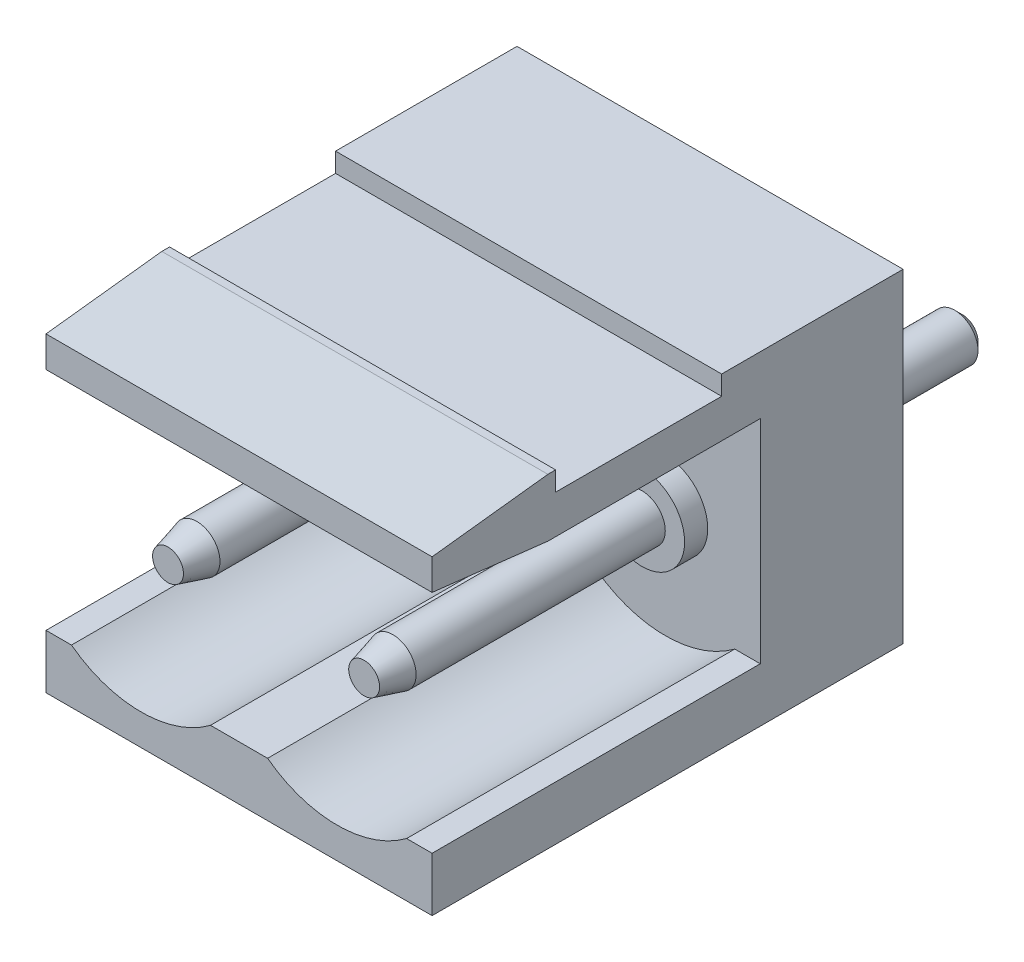
ISO-10303-21;
HEADER;
FILE_DESCRIPTION(('STEP AP214'),'2;1');
FILE_NAME('part.step','',(''),(''),'','','');
FILE_SCHEMA(('AUTOMOTIVE_DESIGN { 1 0 10303 214 1 1 1 1 }'));
ENDSEC;
DATA;
#1=APPLICATION_CONTEXT('core data for automotive mechanical design processes');
#2=APPLICATION_PROTOCOL_DEFINITION('international standard','automotive_design',2000,#1);
#3=PRODUCT_CONTEXT('',#1,'mechanical');
#4=PRODUCT('Part','Part','',(#3));
#5=PRODUCT_RELATED_PRODUCT_CATEGORY('part','',(#4));
#6=PRODUCT_DEFINITION_FORMATION('','',#4);
#7=PRODUCT_DEFINITION_CONTEXT('part definition',#1,'design');
#8=PRODUCT_DEFINITION('design','',#6,#7);
#9=PRODUCT_DEFINITION_SHAPE('','',#8);
#10=(LENGTH_UNIT() NAMED_UNIT(*) SI_UNIT(.MILLI.,.METRE.));
#11=(NAMED_UNIT(*) PLANE_ANGLE_UNIT() SI_UNIT($,.RADIAN.));
#12=(NAMED_UNIT(*) SI_UNIT($,.STERADIAN.) SOLID_ANGLE_UNIT());
#13=UNCERTAINTY_MEASURE_WITH_UNIT(LENGTH_MEASURE(1.E-05),#10,'distance_accuracy_value','');
#14=(GEOMETRIC_REPRESENTATION_CONTEXT(3) GLOBAL_UNCERTAINTY_ASSIGNED_CONTEXT((#13)) GLOBAL_UNIT_ASSIGNED_CONTEXT((#10,
#11,#12)) REPRESENTATION_CONTEXT('',''));
#15=CARTESIAN_POINT('',(0.,0.,0.));
#16=DIRECTION('',(0.,0.,1.));
#17=DIRECTION('',(1.,0.,0.));
#18=AXIS2_PLACEMENT_3D('',#15,#16,#17);
#19=CARTESIAN_POINT('',(0.,8.4,12.2));
#20=DIRECTION('',(0.,-1.,0.));
#21=DIRECTION('',(0.,0.,-1.));
#22=AXIS2_PLACEMENT_3D('',#19,#20,#21);
#23=PLANE('',#22);
#24=DIRECTION('',(0.,0.,-1.));
#25=VECTOR('',#24,1.);
#26=CARTESIAN_POINT('',(0.,8.4,12.2));
#27=LINE('',#26,#25);
#28=CARTESIAN_POINT('',(0.,8.4,4.7));
#29=VERTEX_POINT('',#28);
#30=CARTESIAN_POINT('',(0.,8.4,0.));
#31=VERTEX_POINT('',#30);
#32=EDGE_CURVE('E340',#29,#31,#27,.T.);
#33=ORIENTED_EDGE('',*,*,#32,.F.);
#34=DIRECTION('',(-1.,0.,0.));
#35=VECTOR('',#34,1.);
#36=CARTESIAN_POINT('',(10.,8.4,4.7));
#37=LINE('',#36,#35);
#38=CARTESIAN_POINT('',(10.,8.4,4.7));
#39=VERTEX_POINT('',#38);
#40=EDGE_CURVE('E216',#39,#29,#37,.T.);
#41=ORIENTED_EDGE('',*,*,#40,.F.);
#42=DIRECTION('',(0.,0.,-1.));
#43=VECTOR('',#42,1.);
#44=CARTESIAN_POINT('',(10.,8.4,12.2));
#45=LINE('',#44,#43);
#46=CARTESIAN_POINT('',(10.,8.4,0.));
#47=VERTEX_POINT('',#46);
#48=EDGE_CURVE('E196',#39,#47,#45,.T.);
#49=ORIENTED_EDGE('',*,*,#48,.T.);
#50=DIRECTION('',(-1.,0.,0.));
#51=VECTOR('',#50,1.);
#52=CARTESIAN_POINT('',(0.,8.4,0.));
#53=LINE('',#52,#51);
#54=EDGE_CURVE('E350',#47,#31,#53,.T.);
#55=ORIENTED_EDGE('',*,*,#54,.T.);
#56=EDGE_LOOP('',(#33,#41,#49,#55));
#57=FACE_BOUND('',#56,.T.);
#58=ADVANCED_FACE('F45',(#57),#23,.F.);
#59=CARTESIAN_POINT('',(0.,0.,12.2));
#60=DIRECTION('',(0.,0.,-1.));
#61=DIRECTION('',(-1.,0.,0.));
#62=AXIS2_PLACEMENT_3D('',#59,#60,#61);
#63=PLANE('',#62);
#64=DIRECTION('',(0.,1.,0.));
#65=VECTOR('',#64,1.);
#66=CARTESIAN_POINT('',(10.,0.,12.2));
#67=LINE('',#66,#65);
#68=CARTESIAN_POINT('',(10.,7.25,12.2));
#69=VERTEX_POINT('',#68);
#70=CARTESIAN_POINT('',(10.,8.05,12.2));
#71=VERTEX_POINT('',#70);
#72=EDGE_CURVE('E335',#69,#71,#67,.T.);
#73=ORIENTED_EDGE('',*,*,#72,.T.);
#74=DIRECTION('',(-1.,0.,0.));
#75=VECTOR('',#74,1.);
#76=CARTESIAN_POINT('',(10.,8.05,12.2));
#77=LINE('',#76,#75);
#78=CARTESIAN_POINT('',(0.,8.05,12.2));
#79=VERTEX_POINT('',#78);
#80=EDGE_CURVE('E213',#71,#79,#77,.T.);
#81=ORIENTED_EDGE('',*,*,#80,.T.);
#82=DIRECTION('',(0.,-1.,0.));
#83=VECTOR('',#82,1.);
#84=CARTESIAN_POINT('',(0.,0.,12.2));
#85=LINE('',#84,#83);
#86=CARTESIAN_POINT('',(0.,7.25,12.2));
#87=VERTEX_POINT('',#86);
#88=EDGE_CURVE('E327',#79,#87,#85,.T.);
#89=ORIENTED_EDGE('',*,*,#88,.T.);
#90=DIRECTION('',(-1.,0.,0.));
#91=VECTOR('',#90,1.);
#92=CARTESIAN_POINT('',(10.,7.25,12.2));
#93=LINE('',#92,#91);
#94=EDGE_CURVE('E231',#69,#87,#93,.T.);
#95=ORIENTED_EDGE('',*,*,#94,.F.);
#96=EDGE_LOOP('',(#73,#81,#89,#95));
#97=FACE_BOUND('',#96,.T.);
#98=ADVANCED_FACE('F429',(#97),#63,.F.);
#99=CARTESIAN_POINT('',(0.,0.,12.2));
#100=DIRECTION('',(1.,0.,0.));
#101=DIRECTION('',(0.,0.,-1.));
#102=AXIS2_PLACEMENT_3D('',#99,#100,#101);
#103=PLANE('',#102);
#104=DIRECTION('',(0.,0.,1.));
#105=VECTOR('',#104,1.);
#106=CARTESIAN_POINT('',(0.,7.9,4.7));
#107=LINE('',#106,#105);
#108=CARTESIAN_POINT('',(0.,7.9,4.7));
#109=VERTEX_POINT('',#108);
#110=CARTESIAN_POINT('',(0.,7.9,9.));
#111=VERTEX_POINT('',#110);
#112=EDGE_CURVE('E203',#109,#111,#107,.T.);
#113=ORIENTED_EDGE('',*,*,#112,.F.);
#114=DIRECTION('',(0.,-1.,0.));
#115=VECTOR('',#114,1.);
#116=CARTESIAN_POINT('',(0.,8.4,4.7));
#117=LINE('',#116,#115);
#118=EDGE_CURVE('E177',#29,#109,#117,.T.);
#119=ORIENTED_EDGE('',*,*,#118,.F.);
#120=ORIENTED_EDGE('',*,*,#32,.T.);
#121=DIRECTION('',(0.,-1.,0.));
#122=VECTOR('',#121,1.);
#123=CARTESIAN_POINT('',(0.,0.,0.));
#124=LINE('',#123,#122);
#125=CARTESIAN_POINT('',(0.,0.,0.));
#126=VERTEX_POINT('',#125);
#127=EDGE_CURVE('E303',#31,#126,#124,.T.);
#128=ORIENTED_EDGE('',*,*,#127,.T.);
#129=DIRECTION('',(0.,0.,-1.));
#130=VECTOR('',#129,1.);
#131=CARTESIAN_POINT('',(0.,0.,12.2));
#132=LINE('',#131,#130);
#133=CARTESIAN_POINT('',(0.,0.,12.2));
#134=VERTEX_POINT('',#133);
#135=EDGE_CURVE('E364',#134,#126,#132,.T.);
#136=ORIENTED_EDGE('',*,*,#135,.F.);
#137=CARTESIAN_POINT('',(0.,1.4,12.2));
#138=VERTEX_POINT('',#137);
#139=EDGE_CURVE('E332',#138,#134,#85,.T.);
#140=ORIENTED_EDGE('',*,*,#139,.F.);
#141=DIRECTION('',(0.,0.,1.));
#142=VECTOR('',#141,1.);
#143=CARTESIAN_POINT('',(0.,1.4,3.7));
#144=LINE('',#143,#142);
#145=CARTESIAN_POINT('',(0.,1.4,3.7));
#146=VERTEX_POINT('',#145);
#147=EDGE_CURVE('E300',#146,#138,#144,.T.);
#148=ORIENTED_EDGE('',*,*,#147,.F.);
#149=DIRECTION('',(0.,-1.,0.));
#150=VECTOR('',#149,1.);
#151=CARTESIAN_POINT('',(0.,1.4,3.7));
#152=LINE('',#151,#150);
#153=CARTESIAN_POINT('',(0.,6.9,3.7));
#154=VERTEX_POINT('',#153);
#155=EDGE_CURVE('E279',#154,#146,#152,.T.);
#156=ORIENTED_EDGE('',*,*,#155,.F.);
#157=DIRECTION('',(0.,0.,1.));
#158=VECTOR('',#157,1.);
#159=CARTESIAN_POINT('',(0.,6.9,3.7));
#160=LINE('',#159,#158);
#161=CARTESIAN_POINT('',(0.,6.9,9.2));
#162=VERTEX_POINT('',#161);
#163=EDGE_CURVE('E304',#154,#162,#160,.T.);
#164=ORIENTED_EDGE('',*,*,#163,.T.);
#165=DIRECTION('',(0.,-0.115880699560178,-0.993263139087243));
#166=VECTOR('',#165,1.);
#167=CARTESIAN_POINT('',(0.,6.9,9.2));
#168=LINE('',#167,#166);
#169=EDGE_CURVE('E242',#87,#162,#168,.T.);
#170=ORIENTED_EDGE('',*,*,#169,.F.);
#171=ORIENTED_EDGE('',*,*,#88,.F.);
#172=DIRECTION('',(0.,-0.115880699560178,0.993263139087243));
#173=VECTOR('',#172,1.);
#174=CARTESIAN_POINT('',(0.,8.4,9.2));
#175=LINE('',#174,#173);
#176=CARTESIAN_POINT('',(0.,8.4,9.2));
#177=VERTEX_POINT('',#176);
#178=EDGE_CURVE('E228',#177,#79,#175,.T.);
#179=ORIENTED_EDGE('',*,*,#178,.F.);
#180=CARTESIAN_POINT('',(0.,8.4,9.));
#181=VERTEX_POINT('',#180);
#182=EDGE_CURVE('E356',#177,#181,#27,.T.);
#183=ORIENTED_EDGE('',*,*,#182,.T.);
#184=DIRECTION('',(0.,1.,0.));
#185=VECTOR('',#184,1.);
#186=CARTESIAN_POINT('',(0.,8.4,9.));
#187=LINE('',#186,#185);
#188=EDGE_CURVE('E69',#111,#181,#187,.T.);
#189=ORIENTED_EDGE('',*,*,#188,.F.);
#190=EDGE_LOOP('',(#113,#119,#120,#128,#136,#140,#148,#156,#164,#170,#171,#179,#183,#189));
#191=FACE_BOUND('',#190,.T.);
#192=ADVANCED_FACE('F436',(#191),#103,.F.);
#193=CARTESIAN_POINT('',(0.,0.,12.2));
#194=DIRECTION('',(0.,1.,0.));
#195=DIRECTION('',(0.,0.,1.));
#196=AXIS2_PLACEMENT_3D('',#193,#194,#195);
#197=PLANE('',#196);
#198=DIRECTION('',(1.,0.,0.));
#199=VECTOR('',#198,1.);
#200=CARTESIAN_POINT('',(0.,0.,0.));
#201=LINE('',#200,#199);
#202=CARTESIAN_POINT('',(10.,0.,0.));
#203=VERTEX_POINT('',#202);
#204=EDGE_CURVE('E344',#126,#203,#201,.T.);
#205=ORIENTED_EDGE('',*,*,#204,.T.);
#206=DIRECTION('',(0.,0.,-1.));
#207=VECTOR('',#206,1.);
#208=CARTESIAN_POINT('',(10.,0.,12.2));
#209=LINE('',#208,#207);
#210=CARTESIAN_POINT('',(10.,0.,12.2));
#211=VERTEX_POINT('',#210);
#212=EDGE_CURVE('E360',#211,#203,#209,.T.);
#213=ORIENTED_EDGE('',*,*,#212,.F.);
#214=DIRECTION('',(1.,0.,0.));
#215=VECTOR('',#214,1.);
#216=CARTESIAN_POINT('',(0.,0.,12.2));
#217=LINE('',#216,#215);
#218=EDGE_CURVE('E331',#134,#211,#217,.T.);
#219=ORIENTED_EDGE('',*,*,#218,.F.);
#220=ORIENTED_EDGE('',*,*,#135,.T.);
#221=EDGE_LOOP('',(#205,#213,#219,#220));
#222=FACE_BOUND('',#221,.T.);
#223=ADVANCED_FACE('F451',(#222),#197,.F.);
#224=CARTESIAN_POINT('',(10.,0.,12.2));
#225=DIRECTION('',(-1.,0.,0.));
#226=DIRECTION('',(0.,0.,1.));
#227=AXIS2_PLACEMENT_3D('',#224,#225,#226);
#228=PLANE('',#227);
#229=ORIENTED_EDGE('',*,*,#48,.F.);
#230=DIRECTION('',(0.,-1.,0.));
#231=VECTOR('',#230,1.);
#232=CARTESIAN_POINT('',(10.,8.4,4.7));
#233=LINE('',#232,#231);
#234=CARTESIAN_POINT('',(10.,7.9,4.7));
#235=VERTEX_POINT('',#234);
#236=EDGE_CURVE('E174',#39,#235,#233,.T.);
#237=ORIENTED_EDGE('',*,*,#236,.T.);
#238=DIRECTION('',(0.,0.,1.));
#239=VECTOR('',#238,1.);
#240=CARTESIAN_POINT('',(10.,7.9,4.7));
#241=LINE('',#240,#239);
#242=CARTESIAN_POINT('',(10.,7.9,9.));
#243=VERTEX_POINT('',#242);
#244=EDGE_CURVE('E186',#235,#243,#241,.T.);
#245=ORIENTED_EDGE('',*,*,#244,.T.);
#246=DIRECTION('',(0.,1.,0.));
#247=VECTOR('',#246,1.);
#248=CARTESIAN_POINT('',(10.,8.4,9.));
#249=LINE('',#248,#247);
#250=CARTESIAN_POINT('',(10.,8.4,9.));
#251=VERTEX_POINT('',#250);
#252=EDGE_CURVE('E183',#243,#251,#249,.T.);
#253=ORIENTED_EDGE('',*,*,#252,.T.);
#254=CARTESIAN_POINT('',(10.,8.4,9.2));
#255=VERTEX_POINT('',#254);
#256=EDGE_CURVE('E359',#255,#251,#45,.T.);
#257=ORIENTED_EDGE('',*,*,#256,.F.);
#258=DIRECTION('',(0.,-0.115880699560178,0.993263139087243));
#259=VECTOR('',#258,1.);
#260=CARTESIAN_POINT('',(10.,8.4,9.2));
#261=LINE('',#260,#259);
#262=EDGE_CURVE('E61',#255,#71,#261,.T.);
#263=ORIENTED_EDGE('',*,*,#262,.T.);
#264=ORIENTED_EDGE('',*,*,#72,.F.);
#265=DIRECTION('',(0.,-0.115880699560178,-0.993263139087243));
#266=VECTOR('',#265,1.);
#267=CARTESIAN_POINT('',(10.,6.9,9.2));
#268=LINE('',#267,#266);
#269=CARTESIAN_POINT('',(10.,6.9,9.2));
#270=VERTEX_POINT('',#269);
#271=EDGE_CURVE('E237',#69,#270,#268,.T.);
#272=ORIENTED_EDGE('',*,*,#271,.T.);
#273=DIRECTION('',(0.,0.,1.));
#274=VECTOR('',#273,1.);
#275=CARTESIAN_POINT('',(10.,6.9,3.7));
#276=LINE('',#275,#274);
#277=CARTESIAN_POINT('',(10.,6.9,3.7));
#278=VERTEX_POINT('',#277);
#279=EDGE_CURVE('E308',#278,#270,#276,.T.);
#280=ORIENTED_EDGE('',*,*,#279,.F.);
#281=DIRECTION('',(0.,1.,0.));
#282=VECTOR('',#281,1.);
#283=CARTESIAN_POINT('',(10.,1.4,3.7));
#284=LINE('',#283,#282);
#285=CARTESIAN_POINT('',(10.,1.4,3.7));
#286=VERTEX_POINT('',#285);
#287=EDGE_CURVE('E271',#286,#278,#284,.T.);
#288=ORIENTED_EDGE('',*,*,#287,.F.);
#289=DIRECTION('',(0.,0.,1.));
#290=VECTOR('',#289,1.);
#291=CARTESIAN_POINT('',(10.,1.4,3.7));
#292=LINE('',#291,#290);
#293=CARTESIAN_POINT('',(10.,1.4,12.2));
#294=VERTEX_POINT('',#293);
#295=EDGE_CURVE('E312',#286,#294,#292,.T.);
#296=ORIENTED_EDGE('',*,*,#295,.T.);
#297=EDGE_CURVE('E336',#211,#294,#67,.T.);
#298=ORIENTED_EDGE('',*,*,#297,.F.);
#299=ORIENTED_EDGE('',*,*,#212,.T.);
#300=DIRECTION('',(0.,1.,0.));
#301=VECTOR('',#300,1.);
#302=CARTESIAN_POINT('',(10.,0.,0.));
#303=LINE('',#302,#301);
#304=EDGE_CURVE('E347',#203,#47,#303,.T.);
#305=ORIENTED_EDGE('',*,*,#304,.T.);
#306=EDGE_LOOP('',(#229,#237,#245,#253,#257,#263,#264,#272,#280,#288,#296,#298,#299,#305));
#307=FACE_BOUND('',#306,.T.);
#308=ADVANCED_FACE('F194',(#307),#228,.F.);
#309=ORIENTED_EDGE('',*,*,#256,.T.);
#310=DIRECTION('',(-1.,0.,0.));
#311=VECTOR('',#310,1.);
#312=CARTESIAN_POINT('',(10.,8.4,9.));
#313=LINE('',#312,#311);
#314=EDGE_CURVE('E220',#251,#181,#313,.T.);
#315=ORIENTED_EDGE('',*,*,#314,.T.);
#316=ORIENTED_EDGE('',*,*,#182,.F.);
#317=DIRECTION('',(-1.,0.,0.));
#318=VECTOR('',#317,1.);
#319=CARTESIAN_POINT('',(10.,8.4,9.2));
#320=LINE('',#319,#318);
#321=EDGE_CURVE('E227',#255,#177,#320,.T.);
#322=ORIENTED_EDGE('',*,*,#321,.F.);
#323=EDGE_LOOP('',(#309,#315,#316,#322));
#324=FACE_BOUND('',#323,.T.);
#325=ADVANCED_FACE('F432',(#324),#23,.F.);
#326=CARTESIAN_POINT('',(2.46,3.8,12.2));
#327=DIRECTION('',(0.,0.,1.));
#328=DIRECTION('',(1.,0.,0.));
#329=AXIS2_PLACEMENT_3D('',#326,#327,#328);
#330=CIRCLE('',#329,3.);
#331=CARTESIAN_POINT('',(0.659999999999999,1.4,12.2));
#332=VERTEX_POINT('',#331);
#333=CARTESIAN_POINT('',(4.26,1.4,12.2));
#334=VERTEX_POINT('',#333);
#335=EDGE_CURVE('E286',#332,#334,#330,.T.);
#336=ORIENTED_EDGE('',*,*,#335,.F.);
#337=DIRECTION('',(1.,0.,0.));
#338=VECTOR('',#337,1.);
#339=CARTESIAN_POINT('',(0.,1.4,12.2));
#340=LINE('',#339,#338);
#341=EDGE_CURVE('E219',#138,#332,#340,.T.);
#342=ORIENTED_EDGE('',*,*,#341,.F.);
#343=ORIENTED_EDGE('',*,*,#139,.T.);
#344=ORIENTED_EDGE('',*,*,#218,.T.);
#345=ORIENTED_EDGE('',*,*,#297,.T.);
#346=DIRECTION('',(1.,0.,0.));
#347=VECTOR('',#346,1.);
#348=CARTESIAN_POINT('',(9.34,1.4,12.2));
#349=LINE('',#348,#347);
#350=CARTESIAN_POINT('',(9.34,1.4,12.2));
#351=VERTEX_POINT('',#350);
#352=EDGE_CURVE('E256',#351,#294,#349,.T.);
#353=ORIENTED_EDGE('',*,*,#352,.F.);
#354=CARTESIAN_POINT('',(7.54,3.8,12.2));
#355=DIRECTION('',(0.,0.,1.));
#356=DIRECTION('',(1.,0.,0.));
#357=AXIS2_PLACEMENT_3D('',#354,#355,#356);
#358=CIRCLE('',#357,3.);
#359=CARTESIAN_POINT('',(5.74,1.4,12.2));
#360=VERTEX_POINT('',#359);
#361=EDGE_CURVE('E294',#360,#351,#358,.T.);
#362=ORIENTED_EDGE('',*,*,#361,.F.);
#363=DIRECTION('',(1.,0.,0.));
#364=VECTOR('',#363,1.);
#365=CARTESIAN_POINT('',(4.26,1.4,12.2));
#366=LINE('',#365,#364);
#367=EDGE_CURVE('E290',#334,#360,#366,.T.);
#368=ORIENTED_EDGE('',*,*,#367,.F.);
#369=EDGE_LOOP('',(#336,#342,#343,#344,#345,#353,#362,#368));
#370=FACE_BOUND('',#369,.T.);
#371=ADVANCED_FACE('F439',(#370),#63,.F.);
#372=CARTESIAN_POINT('',(0.,0.,0.));
#373=DIRECTION('',(0.,0.,-1.));
#374=DIRECTION('',(-1.,0.,0.));
#375=AXIS2_PLACEMENT_3D('',#372,#373,#374);
#376=PLANE('',#375);
#377=CARTESIAN_POINT('',(2.46,3.75,0.));
#378=DIRECTION('',(0.,0.,-1.));
#379=DIRECTION('',(-1.,0.,0.));
#380=AXIS2_PLACEMENT_3D('',#377,#378,#379);
#381=CIRCLE('',#380,0.6);
#382=CARTESIAN_POINT('',(1.86,3.75,0.));
#383=VERTEX_POINT('',#382);
#384=EDGE_CURVE('E373',#383,#383,#381,.T.);
#385=ORIENTED_EDGE('',*,*,#384,.F.);
#386=EDGE_LOOP('',(#385));
#387=FACE_BOUND('',#386,.T.);
#388=CARTESIAN_POINT('',(7.54,3.75,0.));
#389=DIRECTION('',(0.,0.,-1.));
#390=DIRECTION('',(-1.,0.,0.));
#391=AXIS2_PLACEMENT_3D('',#388,#389,#390);
#392=CIRCLE('',#391,0.6);
#393=CARTESIAN_POINT('',(6.94,3.75,0.));
#394=VERTEX_POINT('',#393);
#395=EDGE_CURVE('E206',#394,#394,#392,.T.);
#396=ORIENTED_EDGE('',*,*,#395,.F.);
#397=EDGE_LOOP('',(#396));
#398=FACE_BOUND('',#397,.T.);
#399=ORIENTED_EDGE('',*,*,#127,.F.);
#400=ORIENTED_EDGE('',*,*,#54,.F.);
#401=ORIENTED_EDGE('',*,*,#304,.F.);
#402=ORIENTED_EDGE('',*,*,#204,.F.);
#403=EDGE_LOOP('',(#399,#400,#401,#402));
#404=FACE_BOUND('',#403,.T.);
#405=ADVANCED_FACE('F449',(#387,#398,#404),#376,.T.);
#406=CARTESIAN_POINT('',(0.,1.4,3.7));
#407=DIRECTION('',(0.,-1.,0.));
#408=DIRECTION('',(0.,0.,-1.));
#409=AXIS2_PLACEMENT_3D('',#406,#407,#408);
#410=PLANE('',#409);
#411=ORIENTED_EDGE('',*,*,#341,.T.);
#412=DIRECTION('',(0.,0.,1.));
#413=VECTOR('',#412,1.);
#414=CARTESIAN_POINT('',(0.659999999999999,1.4,3.7));
#415=LINE('',#414,#413);
#416=CARTESIAN_POINT('',(0.659999999999999,1.4,3.7));
#417=VERTEX_POINT('',#416);
#418=EDGE_CURVE('E283',#417,#332,#415,.T.);
#419=ORIENTED_EDGE('',*,*,#418,.F.);
#420=DIRECTION('',(1.,0.,0.));
#421=VECTOR('',#420,1.);
#422=CARTESIAN_POINT('',(0.,1.4,3.7));
#423=LINE('',#422,#421);
#424=EDGE_CURVE('E251',#146,#417,#423,.T.);
#425=ORIENTED_EDGE('',*,*,#424,.F.);
#426=ORIENTED_EDGE('',*,*,#147,.T.);
#427=EDGE_LOOP('',(#411,#419,#425,#426));
#428=FACE_BOUND('',#427,.T.);
#429=ADVANCED_FACE('F562',(#428),#410,.F.);
#430=CARTESIAN_POINT('',(0.,6.9,3.7));
#431=DIRECTION('',(0.,1.,0.));
#432=DIRECTION('',(0.,0.,1.));
#433=AXIS2_PLACEMENT_3D('',#430,#431,#432);
#434=PLANE('',#433);
#435=ORIENTED_EDGE('',*,*,#279,.T.);
#436=DIRECTION('',(-1.,0.,0.));
#437=VECTOR('',#436,1.);
#438=CARTESIAN_POINT('',(10.,6.9,9.2));
#439=LINE('',#438,#437);
#440=EDGE_CURVE('E241',#270,#162,#439,.T.);
#441=ORIENTED_EDGE('',*,*,#440,.T.);
#442=ORIENTED_EDGE('',*,*,#163,.F.);
#443=DIRECTION('',(-1.,0.,0.));
#444=VECTOR('',#443,1.);
#445=CARTESIAN_POINT('',(0.,6.9,3.7));
#446=LINE('',#445,#444);
#447=EDGE_CURVE('E275',#278,#154,#446,.T.);
#448=ORIENTED_EDGE('',*,*,#447,.F.);
#449=EDGE_LOOP('',(#435,#441,#442,#448));
#450=FACE_BOUND('',#449,.T.);
#451=ADVANCED_FACE('F599',(#450),#434,.F.);
#452=CARTESIAN_POINT('',(9.34,1.4,3.7));
#453=DIRECTION('',(0.,-1.,0.));
#454=DIRECTION('',(0.,0.,-1.));
#455=AXIS2_PLACEMENT_3D('',#452,#453,#454);
#456=PLANE('',#455);
#457=ORIENTED_EDGE('',*,*,#352,.T.);
#458=ORIENTED_EDGE('',*,*,#295,.F.);
#459=DIRECTION('',(1.,0.,0.));
#460=VECTOR('',#459,1.);
#461=CARTESIAN_POINT('',(9.34,1.4,3.7));
#462=LINE('',#461,#460);
#463=CARTESIAN_POINT('',(9.34,1.4,3.7));
#464=VERTEX_POINT('',#463);
#465=EDGE_CURVE('E268',#464,#286,#462,.T.);
#466=ORIENTED_EDGE('',*,*,#465,.F.);
#467=DIRECTION('',(0.,0.,1.));
#468=VECTOR('',#467,1.);
#469=CARTESIAN_POINT('',(9.34,1.4,3.7));
#470=LINE('',#469,#468);
#471=EDGE_CURVE('E315',#464,#351,#470,.T.);
#472=ORIENTED_EDGE('',*,*,#471,.T.);
#473=EDGE_LOOP('',(#457,#458,#466,#472));
#474=FACE_BOUND('',#473,.T.);
#475=ADVANCED_FACE('F578',(#474),#456,.F.);
#476=CARTESIAN_POINT('',(7.54,3.8,3.7));
#477=DIRECTION('',(0.,0.,1.));
#478=DIRECTION('',(1.,0.,0.));
#479=AXIS2_PLACEMENT_3D('',#476,#477,#478);
#480=CYLINDRICAL_SURFACE('',#479,3.);
#481=ORIENTED_EDGE('',*,*,#361,.T.);
#482=ORIENTED_EDGE('',*,*,#471,.F.);
#483=CARTESIAN_POINT('',(7.54,3.8,3.7));
#484=DIRECTION('',(0.,0.,1.));
#485=DIRECTION('',(1.,0.,0.));
#486=AXIS2_PLACEMENT_3D('',#483,#484,#485);
#487=CIRCLE('',#486,3.);
#488=CARTESIAN_POINT('',(5.74,1.4,3.7));
#489=VERTEX_POINT('',#488);
#490=EDGE_CURVE('E264',#489,#464,#487,.T.);
#491=ORIENTED_EDGE('',*,*,#490,.F.);
#492=DIRECTION('',(0.,0.,1.));
#493=VECTOR('',#492,1.);
#494=CARTESIAN_POINT('',(5.74,1.4,3.7));
#495=LINE('',#494,#493);
#496=EDGE_CURVE('E318',#489,#360,#495,.T.);
#497=ORIENTED_EDGE('',*,*,#496,.T.);
#498=EDGE_LOOP('',(#481,#482,#491,#497));
#499=FACE_BOUND('',#498,.T.);
#500=ADVANCED_FACE('F574',(#499),#480,.F.);
#501=CARTESIAN_POINT('',(4.26,1.4,3.7));
#502=DIRECTION('',(0.,-1.,0.));
#503=DIRECTION('',(0.,0.,-1.));
#504=AXIS2_PLACEMENT_3D('',#501,#502,#503);
#505=PLANE('',#504);
#506=ORIENTED_EDGE('',*,*,#367,.T.);
#507=ORIENTED_EDGE('',*,*,#496,.F.);
#508=DIRECTION('',(1.,0.,0.));
#509=VECTOR('',#508,1.);
#510=CARTESIAN_POINT('',(4.26,1.4,3.7));
#511=LINE('',#510,#509);
#512=CARTESIAN_POINT('',(4.26,1.4,3.7));
#513=VERTEX_POINT('',#512);
#514=EDGE_CURVE('E260',#513,#489,#511,.T.);
#515=ORIENTED_EDGE('',*,*,#514,.F.);
#516=DIRECTION('',(0.,0.,1.));
#517=VECTOR('',#516,1.);
#518=CARTESIAN_POINT('',(4.26,1.4,3.7));
#519=LINE('',#518,#517);
#520=EDGE_CURVE('E321',#513,#334,#519,.T.);
#521=ORIENTED_EDGE('',*,*,#520,.T.);
#522=EDGE_LOOP('',(#506,#507,#515,#521));
#523=FACE_BOUND('',#522,.T.);
#524=ADVANCED_FACE('F569',(#523),#505,.F.);
#525=CARTESIAN_POINT('',(2.46,3.8,3.7));
#526=DIRECTION('',(0.,0.,1.));
#527=DIRECTION('',(1.,0.,0.));
#528=AXIS2_PLACEMENT_3D('',#525,#526,#527);
#529=CYLINDRICAL_SURFACE('',#528,3.);
#530=ORIENTED_EDGE('',*,*,#335,.T.);
#531=ORIENTED_EDGE('',*,*,#520,.F.);
#532=CARTESIAN_POINT('',(2.46,3.8,3.7));
#533=DIRECTION('',(0.,0.,1.));
#534=DIRECTION('',(1.,0.,0.));
#535=AXIS2_PLACEMENT_3D('',#532,#533,#534);
#536=CIRCLE('',#535,3.);
#537=EDGE_CURVE('E255',#417,#513,#536,.T.);
#538=ORIENTED_EDGE('',*,*,#537,.F.);
#539=ORIENTED_EDGE('',*,*,#418,.T.);
#540=EDGE_LOOP('',(#530,#531,#538,#539));
#541=FACE_BOUND('',#540,.T.);
#542=ADVANCED_FACE('F554',(#541),#529,.F.);
#543=CARTESIAN_POINT('',(2.46,3.8,3.7));
#544=DIRECTION('',(0.,0.,1.));
#545=DIRECTION('',(1.,0.,0.));
#546=AXIS2_PLACEMENT_3D('',#543,#544,#545);
#547=PLANE('',#546);
#548=CARTESIAN_POINT('',(7.54,3.75,3.7));
#549=DIRECTION('',(0.,0.,1.));
#550=DIRECTION('',(1.,0.,0.));
#551=AXIS2_PLACEMENT_3D('',#548,#549,#550);
#552=CIRCLE('',#551,1.1);
#553=CARTESIAN_POINT('',(8.64,3.75,3.7));
#554=VERTEX_POINT('',#553);
#555=EDGE_CURVE('E524',#554,#554,#552,.T.);
#556=ORIENTED_EDGE('',*,*,#555,.F.);
#557=EDGE_LOOP('',(#556));
#558=FACE_BOUND('',#557,.T.);
#559=CARTESIAN_POINT('',(2.46,3.75,3.7));
#560=DIRECTION('',(0.,0.,1.));
#561=DIRECTION('',(1.,0.,0.));
#562=AXIS2_PLACEMENT_3D('',#559,#560,#561);
#563=CIRCLE('',#562,1.1);
#564=CARTESIAN_POINT('',(3.56,3.75,3.7));
#565=VERTEX_POINT('',#564);
#566=EDGE_CURVE('E483',#565,#565,#563,.T.);
#567=ORIENTED_EDGE('',*,*,#566,.F.);
#568=EDGE_LOOP('',(#567));
#569=FACE_BOUND('',#568,.T.);
#570=ORIENTED_EDGE('',*,*,#424,.T.);
#571=ORIENTED_EDGE('',*,*,#537,.T.);
#572=ORIENTED_EDGE('',*,*,#514,.T.);
#573=ORIENTED_EDGE('',*,*,#490,.T.);
#574=ORIENTED_EDGE('',*,*,#465,.T.);
#575=ORIENTED_EDGE('',*,*,#287,.T.);
#576=ORIENTED_EDGE('',*,*,#447,.T.);
#577=ORIENTED_EDGE('',*,*,#155,.T.);
#578=EDGE_LOOP('',(#570,#571,#572,#573,#574,#575,#576,#577));
#579=FACE_BOUND('',#578,.T.);
#580=ADVANCED_FACE('F550',(#558,#569,#579),#547,.T.);
#581=CARTESIAN_POINT('',(10.,6.9,9.2));
#582=DIRECTION('',(0.,0.993263139087243,-0.115880699560178));
#583=DIRECTION('',(0.,0.115880699560178,0.993263139087243));
#584=AXIS2_PLACEMENT_3D('',#581,#582,#583);
#585=PLANE('',#584);
#586=ORIENTED_EDGE('',*,*,#169,.T.);
#587=ORIENTED_EDGE('',*,*,#440,.F.);
#588=ORIENTED_EDGE('',*,*,#271,.F.);
#589=ORIENTED_EDGE('',*,*,#94,.T.);
#590=EDGE_LOOP('',(#586,#587,#588,#589));
#591=FACE_BOUND('',#590,.T.);
#592=ADVANCED_FACE('F553',(#591),#585,.F.);
#593=CARTESIAN_POINT('',(10.,8.4,9.2));
#594=DIRECTION('',(0.,-0.993263139087243,-0.115880699560178));
#595=DIRECTION('',(0.,0.115880699560178,-0.993263139087243));
#596=AXIS2_PLACEMENT_3D('',#593,#594,#595);
#597=PLANE('',#596);
#598=ORIENTED_EDGE('',*,*,#178,.T.);
#599=ORIENTED_EDGE('',*,*,#80,.F.);
#600=ORIENTED_EDGE('',*,*,#262,.F.);
#601=ORIENTED_EDGE('',*,*,#321,.T.);
#602=EDGE_LOOP('',(#598,#599,#600,#601));
#603=FACE_BOUND('',#602,.T.);
#604=ADVANCED_FACE('F594',(#603),#597,.F.);
#605=CARTESIAN_POINT('',(10.,8.4,4.7));
#606=DIRECTION('',(0.,0.,-1.));
#607=DIRECTION('',(-1.,0.,0.));
#608=AXIS2_PLACEMENT_3D('',#605,#606,#607);
#609=PLANE('',#608);
#610=ORIENTED_EDGE('',*,*,#118,.T.);
#611=DIRECTION('',(-1.,0.,0.));
#612=VECTOR('',#611,1.);
#613=CARTESIAN_POINT('',(10.,7.9,4.7));
#614=LINE('',#613,#612);
#615=EDGE_CURVE('E170',#235,#109,#614,.T.);
#616=ORIENTED_EDGE('',*,*,#615,.F.);
#617=ORIENTED_EDGE('',*,*,#236,.F.);
#618=ORIENTED_EDGE('',*,*,#40,.T.);
#619=EDGE_LOOP('',(#610,#616,#617,#618));
#620=FACE_BOUND('',#619,.T.);
#621=ADVANCED_FACE('F172',(#620),#609,.F.);
#622=CARTESIAN_POINT('',(10.,8.4,9.));
#623=DIRECTION('',(0.,0.,1.));
#624=DIRECTION('',(1.,0.,0.));
#625=AXIS2_PLACEMENT_3D('',#622,#623,#624);
#626=PLANE('',#625);
#627=ORIENTED_EDGE('',*,*,#188,.T.);
#628=ORIENTED_EDGE('',*,*,#314,.F.);
#629=ORIENTED_EDGE('',*,*,#252,.F.);
#630=DIRECTION('',(-1.,0.,0.));
#631=VECTOR('',#630,1.);
#632=CARTESIAN_POINT('',(10.,7.9,9.));
#633=LINE('',#632,#631);
#634=EDGE_CURVE('E182',#243,#111,#633,.T.);
#635=ORIENTED_EDGE('',*,*,#634,.T.);
#636=EDGE_LOOP('',(#627,#628,#629,#635));
#637=FACE_BOUND('',#636,.T.);
#638=ADVANCED_FACE('F640',(#637),#626,.F.);
#639=CARTESIAN_POINT('',(10.,7.9,4.7));
#640=DIRECTION('',(0.,-1.,0.));
#641=DIRECTION('',(0.,0.,-1.));
#642=AXIS2_PLACEMENT_3D('',#639,#640,#641);
#643=PLANE('',#642);
#644=ORIENTED_EDGE('',*,*,#112,.T.);
#645=ORIENTED_EDGE('',*,*,#634,.F.);
#646=ORIENTED_EDGE('',*,*,#244,.F.);
#647=ORIENTED_EDGE('',*,*,#615,.T.);
#648=EDGE_LOOP('',(#644,#645,#646,#647));
#649=FACE_BOUND('',#648,.T.);
#650=ADVANCED_FACE('F187',(#649),#643,.F.);
#651=CARTESIAN_POINT('',(7.54,3.75,11.5));
#652=DIRECTION('',(0.,0.,-1.));
#653=DIRECTION('',(-1.,0.,0.));
#654=AXIS2_PLACEMENT_3D('',#651,#652,#653);
#655=CYLINDRICAL_SURFACE('',#654,0.6);
#656=CARTESIAN_POINT('',(7.54,3.75,-3.8));
#657=DIRECTION('',(0.,0.,-1.));
#658=DIRECTION('',(-1.,0.,0.));
#659=AXIS2_PLACEMENT_3D('',#656,#657,#658);
#660=CIRCLE('',#659,0.6);
#661=CARTESIAN_POINT('',(6.94,3.75,-3.8));
#662=VERTEX_POINT('',#661);
#663=EDGE_CURVE('E389',#662,#662,#660,.F.);
#664=ORIENTED_EDGE('',*,*,#663,.T.);
#665=EDGE_LOOP('',(#664));
#666=FACE_BOUND('',#665,.T.);
#667=ORIENTED_EDGE('',*,*,#395,.T.);
#668=EDGE_LOOP('',(#667));
#669=FACE_BOUND('',#668,.T.);
#670=ADVANCED_FACE('F628',(#666,#669),#655,.T.);
#671=CARTESIAN_POINT('',(7.54,3.75,-4.));
#672=DIRECTION('',(0.,0.,-1.));
#673=DIRECTION('',(-1.,0.,0.));
#674=AXIS2_PLACEMENT_3D('',#671,#672,#673);
#675=PLANE('',#674);
#676=CARTESIAN_POINT('',(7.54,3.75,-4.));
#677=DIRECTION('',(0.,0.,-1.));
#678=DIRECTION('',(-1.,0.,0.));
#679=AXIS2_PLACEMENT_3D('',#676,#677,#678);
#680=CIRCLE('',#679,0.400000000000002);
#681=CARTESIAN_POINT('',(7.14,3.75,-4.));
#682=VERTEX_POINT('',#681);
#683=EDGE_CURVE('E385',#682,#682,#680,.T.);
#684=ORIENTED_EDGE('',*,*,#683,.T.);
#685=EDGE_LOOP('',(#684));
#686=FACE_BOUND('',#685,.T.);
#687=ADVANCED_FACE('F630',(#686),#675,.T.);
#688=CARTESIAN_POINT('',(2.46,3.75,11.5));
#689=DIRECTION('',(0.,0.,-1.));
#690=DIRECTION('',(-1.,0.,0.));
#691=AXIS2_PLACEMENT_3D('',#688,#689,#690);
#692=CYLINDRICAL_SURFACE('',#691,0.6);
#693=CARTESIAN_POINT('',(2.46,3.75,-3.8));
#694=DIRECTION('',(0.,0.,-1.));
#695=DIRECTION('',(-1.,0.,0.));
#696=AXIS2_PLACEMENT_3D('',#693,#694,#695);
#697=CIRCLE('',#696,0.6);
#698=CARTESIAN_POINT('',(1.86,3.75,-3.8));
#699=VERTEX_POINT('',#698);
#700=EDGE_CURVE('E397',#699,#699,#697,.F.);
#701=ORIENTED_EDGE('',*,*,#700,.T.);
#702=EDGE_LOOP('',(#701));
#703=FACE_BOUND('',#702,.T.);
#704=ORIENTED_EDGE('',*,*,#384,.T.);
#705=EDGE_LOOP('',(#704));
#706=FACE_BOUND('',#705,.T.);
#707=ADVANCED_FACE('F414',(#703,#706),#692,.T.);
#708=CARTESIAN_POINT('',(2.46,3.75,-4.));
#709=DIRECTION('',(0.,0.,-1.));
#710=DIRECTION('',(-1.,0.,0.));
#711=AXIS2_PLACEMENT_3D('',#708,#709,#710);
#712=PLANE('',#711);
#713=CARTESIAN_POINT('',(2.46,3.75,-4.));
#714=DIRECTION('',(0.,0.,-1.));
#715=DIRECTION('',(-1.,0.,0.));
#716=AXIS2_PLACEMENT_3D('',#713,#714,#715);
#717=CIRCLE('',#716,0.399999999999999);
#718=CARTESIAN_POINT('',(2.06,3.75,-4.));
#719=VERTEX_POINT('',#718);
#720=EDGE_CURVE('E393',#719,#719,#717,.T.);
#721=ORIENTED_EDGE('',*,*,#720,.T.);
#722=EDGE_LOOP('',(#721));
#723=FACE_BOUND('',#722,.T.);
#724=ADVANCED_FACE('F674',(#723),#712,.T.);
#725=CARTESIAN_POINT('',(7.54,3.75,-4.));
#726=DIRECTION('',(0.,0.,1.));
#727=DIRECTION('',(1.,0.,0.));
#728=AXIS2_PLACEMENT_3D('',#725,#726,#727);
#729=CONICAL_SURFACE('',#728,0.400000000000002,0.785398163397451);
#730=ORIENTED_EDGE('',*,*,#663,.F.);
#731=EDGE_LOOP('',(#730));
#732=FACE_BOUND('',#731,.T.);
#733=ORIENTED_EDGE('',*,*,#683,.F.);
#734=EDGE_LOOP('',(#733));
#735=FACE_BOUND('',#734,.T.);
#736=ADVANCED_FACE('F676',(#732,#735),#729,.T.);
#737=CARTESIAN_POINT('',(2.46,3.75,-4.));
#738=DIRECTION('',(0.,0.,1.));
#739=DIRECTION('',(1.,0.,0.));
#740=AXIS2_PLACEMENT_3D('',#737,#738,#739);
#741=CONICAL_SURFACE('',#740,0.399999999999999,0.785398163397448);
#742=ORIENTED_EDGE('',*,*,#700,.F.);
#743=EDGE_LOOP('',(#742));
#744=FACE_BOUND('',#743,.T.);
#745=ORIENTED_EDGE('',*,*,#720,.F.);
#746=EDGE_LOOP('',(#745));
#747=FACE_BOUND('',#746,.T.);
#748=ADVANCED_FACE('F47',(#744,#747),#741,.T.);
#749=CARTESIAN_POINT('',(2.46,3.75,4.3));
#750=DIRECTION('',(0.,0.,-1.));
#751=DIRECTION('',(-1.,0.,0.));
#752=AXIS2_PLACEMENT_3D('',#749,#750,#751);
#753=CYLINDRICAL_SURFACE('',#752,1.1);
#754=CARTESIAN_POINT('',(2.46,3.75,4.3));
#755=DIRECTION('',(0.,0.,1.));
#756=DIRECTION('',(1.,0.,0.));
#757=AXIS2_PLACEMENT_3D('',#754,#755,#756);
#758=CIRCLE('',#757,1.1);
#759=CARTESIAN_POINT('',(3.56,3.75,4.3));
#760=VERTEX_POINT('',#759);
#761=EDGE_CURVE('E245',#760,#760,#758,.T.);
#762=ORIENTED_EDGE('',*,*,#761,.F.);
#763=EDGE_LOOP('',(#762));
#764=FACE_BOUND('',#763,.T.);
#765=ORIENTED_EDGE('',*,*,#566,.T.);
#766=EDGE_LOOP('',(#765));
#767=FACE_BOUND('',#766,.T.);
#768=ADVANCED_FACE('F670',(#764,#767),#753,.T.);
#769=CARTESIAN_POINT('',(2.46,3.75,4.3));
#770=DIRECTION('',(0.,0.,1.));
#771=DIRECTION('',(1.,0.,0.));
#772=AXIS2_PLACEMENT_3D('',#769,#770,#771);
#773=PLANE('',#772);
#774=CARTESIAN_POINT('',(2.46,3.75,4.3));
#775=DIRECTION('',(0.,0.,1.));
#776=DIRECTION('',(1.,0.,0.));
#777=AXIS2_PLACEMENT_3D('',#774,#775,#776);
#778=CIRCLE('',#777,0.6);
#779=CARTESIAN_POINT('',(3.06,3.75,4.3));
#780=VERTEX_POINT('',#779);
#781=EDGE_CURVE('E54',#780,#780,#778,.F.);
#782=ORIENTED_EDGE('',*,*,#781,.T.);
#783=EDGE_LOOP('',(#782));
#784=FACE_BOUND('',#783,.T.);
#785=ORIENTED_EDGE('',*,*,#761,.T.);
#786=EDGE_LOOP('',(#785));
#787=FACE_BOUND('',#786,.T.);
#788=ADVANCED_FACE('F405',(#784,#787),#773,.T.);
#789=CARTESIAN_POINT('',(2.46,3.75,11.5));
#790=DIRECTION('',(0.,0.,-1.));
#791=DIRECTION('',(-1.,0.,0.));
#792=AXIS2_PLACEMENT_3D('',#789,#790,#791);
#793=PLANE('',#792);
#794=CARTESIAN_POINT('',(2.46,3.75,11.5));
#795=DIRECTION('',(0.,0.,-1.));
#796=DIRECTION('',(-1.,0.,0.));
#797=AXIS2_PLACEMENT_3D('',#794,#795,#796);
#798=CIRCLE('',#797,0.399999999999998);
#799=CARTESIAN_POINT('',(2.06,3.75,11.5));
#800=VERTEX_POINT('',#799);
#801=EDGE_CURVE('E381',#800,#800,#798,.F.);
#802=ORIENTED_EDGE('',*,*,#801,.T.);
#803=EDGE_LOOP('',(#802));
#804=FACE_BOUND('',#803,.T.);
#805=ADVANCED_FACE('F418',(#804),#793,.F.);
#806=CARTESIAN_POINT('',(2.46,3.75,10.7535898384862));
#807=DIRECTION('',(0.,0.,-1.));
#808=DIRECTION('',(-1.,0.,0.));
#809=AXIS2_PLACEMENT_3D('',#806,#807,#808);
#810=CONICAL_SURFACE('',#809,0.6,0.261799387799148);
#811=ORIENTED_EDGE('',*,*,#801,.F.);
#812=EDGE_LOOP('',(#811));
#813=FACE_BOUND('',#812,.T.);
#814=CARTESIAN_POINT('',(2.46,3.75,10.7535898384862));
#815=DIRECTION('',(0.,0.,-1.));
#816=DIRECTION('',(-1.,0.,0.));
#817=AXIS2_PLACEMENT_3D('',#814,#815,#816);
#818=CIRCLE('',#817,0.6);
#819=CARTESIAN_POINT('',(1.86,3.75,10.7535898384862));
#820=VERTEX_POINT('',#819);
#821=EDGE_CURVE('E377',#820,#820,#818,.T.);
#822=ORIENTED_EDGE('',*,*,#821,.F.);
#823=EDGE_LOOP('',(#822));
#824=FACE_BOUND('',#823,.T.);
#825=ADVANCED_FACE('F412',(#813,#824),#810,.T.);
#826=ORIENTED_EDGE('',*,*,#781,.F.);
#827=EDGE_LOOP('',(#826));
#828=FACE_BOUND('',#827,.T.);
#829=ORIENTED_EDGE('',*,*,#821,.T.);
#830=EDGE_LOOP('',(#829));
#831=FACE_BOUND('',#830,.T.);
#832=ADVANCED_FACE('F408',(#828,#831),#692,.T.);
#833=CARTESIAN_POINT('',(7.54,3.75,4.3));
#834=DIRECTION('',(0.,0.,-1.));
#835=DIRECTION('',(-1.,0.,0.));
#836=AXIS2_PLACEMENT_3D('',#833,#834,#835);
#837=CYLINDRICAL_SURFACE('',#836,1.1);
#838=CARTESIAN_POINT('',(7.54,3.75,4.3));
#839=DIRECTION('',(0.,0.,1.));
#840=DIRECTION('',(1.,0.,0.));
#841=AXIS2_PLACEMENT_3D('',#838,#839,#840);
#842=CIRCLE('',#841,1.1);
#843=CARTESIAN_POINT('',(8.64,3.75,4.3));
#844=VERTEX_POINT('',#843);
#845=EDGE_CURVE('E521',#844,#844,#842,.T.);
#846=ORIENTED_EDGE('',*,*,#845,.F.);
#847=EDGE_LOOP('',(#846));
#848=FACE_BOUND('',#847,.T.);
#849=ORIENTED_EDGE('',*,*,#555,.T.);
#850=EDGE_LOOP('',(#849));
#851=FACE_BOUND('',#850,.T.);
#852=ADVANCED_FACE('F411',(#848,#851),#837,.T.);
#853=CARTESIAN_POINT('',(7.54,3.75,4.3));
#854=DIRECTION('',(0.,0.,1.));
#855=DIRECTION('',(1.,0.,0.));
#856=AXIS2_PLACEMENT_3D('',#853,#854,#855);
#857=PLANE('',#856);
#858=CARTESIAN_POINT('',(7.54,3.75,4.3));
#859=DIRECTION('',(0.,0.,1.));
#860=DIRECTION('',(1.,0.,0.));
#861=AXIS2_PLACEMENT_3D('',#858,#859,#860);
#862=CIRCLE('',#861,0.6);
#863=CARTESIAN_POINT('',(8.14,3.75,4.3));
#864=VERTEX_POINT('',#863);
#865=EDGE_CURVE('E11',#864,#864,#862,.F.);
#866=ORIENTED_EDGE('',*,*,#865,.T.);
#867=EDGE_LOOP('',(#866));
#868=FACE_BOUND('',#867,.T.);
#869=ORIENTED_EDGE('',*,*,#845,.T.);
#870=EDGE_LOOP('',(#869));
#871=FACE_BOUND('',#870,.T.);
#872=ADVANCED_FACE('F657',(#868,#871),#857,.T.);
#873=CARTESIAN_POINT('',(7.54,3.75,11.5));
#874=DIRECTION('',(0.,0.,-1.));
#875=DIRECTION('',(-1.,0.,0.));
#876=AXIS2_PLACEMENT_3D('',#873,#874,#875);
#877=PLANE('',#876);
#878=CARTESIAN_POINT('',(7.54,3.75,11.5));
#879=DIRECTION('',(0.,0.,-1.));
#880=DIRECTION('',(-1.,0.,0.));
#881=AXIS2_PLACEMENT_3D('',#878,#879,#880);
#882=CIRCLE('',#881,0.399999999999998);
#883=CARTESIAN_POINT('',(7.14,3.75,11.5));
#884=VERTEX_POINT('',#883);
#885=EDGE_CURVE('E372',#884,#884,#882,.F.);
#886=ORIENTED_EDGE('',*,*,#885,.T.);
#887=EDGE_LOOP('',(#886));
#888=FACE_BOUND('',#887,.T.);
#889=ADVANCED_FACE('F650',(#888),#877,.F.);
#890=CARTESIAN_POINT('',(7.54,3.75,10.7535898384862));
#891=DIRECTION('',(0.,0.,-1.));
#892=DIRECTION('',(-1.,0.,0.));
#893=AXIS2_PLACEMENT_3D('',#890,#891,#892);
#894=CONICAL_SURFACE('',#893,0.6,0.261799387799147);
#895=ORIENTED_EDGE('',*,*,#885,.F.);
#896=EDGE_LOOP('',(#895));
#897=FACE_BOUND('',#896,.T.);
#898=CARTESIAN_POINT('',(7.54,3.75,10.7535898384862));
#899=DIRECTION('',(0.,0.,-1.));
#900=DIRECTION('',(-1.,0.,0.));
#901=AXIS2_PLACEMENT_3D('',#898,#899,#900);
#902=CIRCLE('',#901,0.6);
#903=CARTESIAN_POINT('',(6.94,3.75,10.7535898384862));
#904=VERTEX_POINT('',#903);
#905=EDGE_CURVE('E368',#904,#904,#902,.T.);
#906=ORIENTED_EDGE('',*,*,#905,.F.);
#907=EDGE_LOOP('',(#906));
#908=FACE_BOUND('',#907,.T.);
#909=ADVANCED_FACE('F645',(#897,#908),#894,.T.);
#910=ORIENTED_EDGE('',*,*,#865,.F.);
#911=EDGE_LOOP('',(#910));
#912=FACE_BOUND('',#911,.T.);
#913=ORIENTED_EDGE('',*,*,#905,.T.);
#914=EDGE_LOOP('',(#913));
#915=FACE_BOUND('',#914,.T.);
#916=ADVANCED_FACE('F633',(#912,#915),#655,.T.);
#917=CLOSED_SHELL('',(#58,#98,#192,#223,#308,#325,#371,#405,#429,#451,#475,#500,#524,#542,#580,
#592,#604,#621,#638,#650,#670,#687,#707,#724,#736,#748,#768,#788,#805,#825,#832,#852,#872,#889,
#909,#916));
#918=MANIFOLD_SOLID_BREP('B2',#917);
#919=ADVANCED_BREP_SHAPE_REPRESENTATION('',(#18,#918),#14);
#920=SHAPE_DEFINITION_REPRESENTATION(#9,#919);
ENDSEC;
END-ISO-10303-21;
